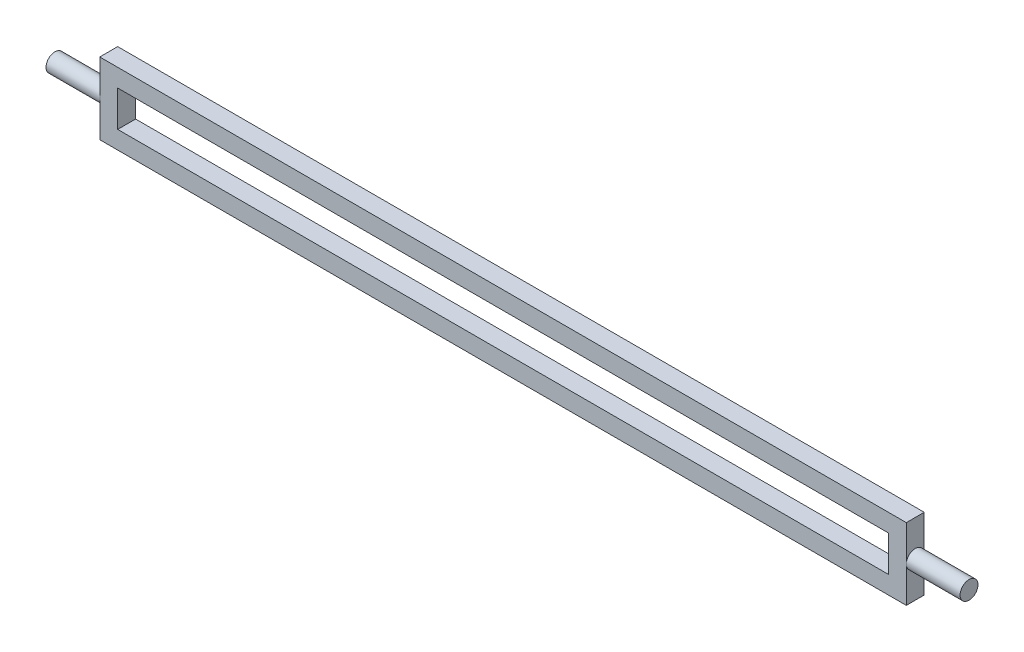
ISO-10303-21;
HEADER;
FILE_DESCRIPTION(('STEP AP214'),'2;1');
FILE_NAME('part.step','',(''),(''),'','','');
FILE_SCHEMA(('AUTOMOTIVE_DESIGN { 1 0 10303 214 1 1 1 1 }'));
ENDSEC;
DATA;
#1=APPLICATION_CONTEXT('core data for automotive mechanical design processes');
#2=APPLICATION_PROTOCOL_DEFINITION('international standard','automotive_design',2000,#1);
#3=PRODUCT_CONTEXT('',#1,'mechanical');
#4=PRODUCT('Part','Part','',(#3));
#5=PRODUCT_RELATED_PRODUCT_CATEGORY('part','',(#4));
#6=PRODUCT_DEFINITION_FORMATION('','',#4);
#7=PRODUCT_DEFINITION_CONTEXT('part definition',#1,'design');
#8=PRODUCT_DEFINITION('design','',#6,#7);
#9=PRODUCT_DEFINITION_SHAPE('','',#8);
#10=(LENGTH_UNIT() NAMED_UNIT(*) SI_UNIT(.MILLI.,.METRE.));
#11=(NAMED_UNIT(*) PLANE_ANGLE_UNIT() SI_UNIT($,.RADIAN.));
#12=(NAMED_UNIT(*) SI_UNIT($,.STERADIAN.) SOLID_ANGLE_UNIT());
#13=UNCERTAINTY_MEASURE_WITH_UNIT(LENGTH_MEASURE(1.E-05),#10,'distance_accuracy_value','');
#14=(GEOMETRIC_REPRESENTATION_CONTEXT(3) GLOBAL_UNCERTAINTY_ASSIGNED_CONTEXT((#13)) GLOBAL_UNIT_ASSIGNED_CONTEXT((#10,
#11,#12)) REPRESENTATION_CONTEXT('',''));
#15=CARTESIAN_POINT('',(0.,0.,0.));
#16=DIRECTION('',(0.,0.,1.));
#17=DIRECTION('',(1.,0.,0.));
#18=AXIS2_PLACEMENT_3D('',#15,#16,#17);
#19=CARTESIAN_POINT('',(0.,0.,5.));
#20=DIRECTION('',(1.,0.,0.));
#21=DIRECTION('',(0.,0.,-1.));
#22=AXIS2_PLACEMENT_3D('',#19,#20,#21);
#23=PLANE('',#22);
#24=CARTESIAN_POINT('',(0.,10.,2.5));
#25=DIRECTION('',(-1.,0.,0.));
#26=DIRECTION('',(0.,0.,1.));
#27=AXIS2_PLACEMENT_3D('',#24,#25,#26);
#28=CIRCLE('',#27,2.5);
#29=CARTESIAN_POINT('',(0.,10.,5.));
#30=VERTEX_POINT('',#29);
#31=CARTESIAN_POINT('',(0.,10.,0.));
#32=VERTEX_POINT('',#31);
#33=EDGE_CURVE('E44',#30,#32,#28,.T.);
#34=ORIENTED_EDGE('',*,*,#33,.F.);
#35=DIRECTION('',(0.,-1.,0.));
#36=VECTOR('',#35,1.);
#37=CARTESIAN_POINT('',(0.,0.,5.));
#38=LINE('',#37,#36);
#39=CARTESIAN_POINT('',(0.,20.,5.));
#40=VERTEX_POINT('',#39);
#41=EDGE_CURVE('E160',#40,#30,#38,.T.);
#42=ORIENTED_EDGE('',*,*,#41,.F.);
#43=DIRECTION('',(0.,0.,-1.));
#44=VECTOR('',#43,1.);
#45=CARTESIAN_POINT('',(0.,20.,5.));
#46=LINE('',#45,#44);
#47=CARTESIAN_POINT('',(0.,20.,0.));
#48=VERTEX_POINT('',#47);
#49=EDGE_CURVE('E171',#40,#48,#46,.T.);
#50=ORIENTED_EDGE('',*,*,#49,.T.);
#51=DIRECTION('',(0.,-1.,0.));
#52=VECTOR('',#51,1.);
#53=CARTESIAN_POINT('',(0.,0.,0.));
#54=LINE('',#53,#52);
#55=EDGE_CURVE('E172',#48,#32,#54,.T.);
#56=ORIENTED_EDGE('',*,*,#55,.T.);
#57=EDGE_LOOP('',(#34,#42,#50,#56));
#58=FACE_BOUND('',#57,.T.);
#59=ADVANCED_FACE('F33',(#58),#23,.F.);
#60=CARTESIAN_POINT('',(225.,0.,5.));
#61=DIRECTION('',(-1.,0.,0.));
#62=DIRECTION('',(0.,0.,1.));
#63=AXIS2_PLACEMENT_3D('',#60,#61,#62);
#64=PLANE('',#63);
#65=CARTESIAN_POINT('',(225.,10.,2.5));
#66=DIRECTION('',(1.,0.,0.));
#67=DIRECTION('',(0.,0.,-1.));
#68=AXIS2_PLACEMENT_3D('',#65,#66,#67);
#69=CIRCLE('',#68,2.5);
#70=CARTESIAN_POINT('',(225.,10.,0.));
#71=VERTEX_POINT('',#70);
#72=CARTESIAN_POINT('',(225.,10.,5.));
#73=VERTEX_POINT('',#72);
#74=EDGE_CURVE('E151',#71,#73,#69,.T.);
#75=ORIENTED_EDGE('',*,*,#74,.F.);
#76=DIRECTION('',(0.,1.,0.));
#77=VECTOR('',#76,1.);
#78=CARTESIAN_POINT('',(225.,0.,0.));
#79=LINE('',#78,#77);
#80=CARTESIAN_POINT('',(225.,20.,0.));
#81=VERTEX_POINT('',#80);
#82=EDGE_CURVE('E177',#71,#81,#79,.T.);
#83=ORIENTED_EDGE('',*,*,#82,.T.);
#84=DIRECTION('',(0.,0.,-1.));
#85=VECTOR('',#84,1.);
#86=CARTESIAN_POINT('',(225.,20.,5.));
#87=LINE('',#86,#85);
#88=CARTESIAN_POINT('',(225.,20.,5.));
#89=VERTEX_POINT('',#88);
#90=EDGE_CURVE('E184',#89,#81,#87,.T.);
#91=ORIENTED_EDGE('',*,*,#90,.F.);
#92=DIRECTION('',(0.,1.,0.));
#93=VECTOR('',#92,1.);
#94=CARTESIAN_POINT('',(225.,0.,5.));
#95=LINE('',#94,#93);
#96=EDGE_CURVE('E165',#73,#89,#95,.T.);
#97=ORIENTED_EDGE('',*,*,#96,.F.);
#98=EDGE_LOOP('',(#75,#83,#91,#97));
#99=FACE_BOUND('',#98,.T.);
#100=ADVANCED_FACE('F205',(#99),#64,.F.);
#101=EDGE_CURVE('E11',#32,#30,#28,.T.);
#102=ORIENTED_EDGE('',*,*,#101,.F.);
#103=CARTESIAN_POINT('',(0.,0.,0.));
#104=VERTEX_POINT('',#103);
#105=EDGE_CURVE('E157',#32,#104,#54,.T.);
#106=ORIENTED_EDGE('',*,*,#105,.T.);
#107=DIRECTION('',(0.,0.,-1.));
#108=VECTOR('',#107,1.);
#109=CARTESIAN_POINT('',(0.,0.,5.));
#110=LINE('',#109,#108);
#111=CARTESIAN_POINT('',(0.,0.,5.));
#112=VERTEX_POINT('',#111);
#113=EDGE_CURVE('E37',#112,#104,#110,.T.);
#114=ORIENTED_EDGE('',*,*,#113,.F.);
#115=EDGE_CURVE('E163',#30,#112,#38,.T.);
#116=ORIENTED_EDGE('',*,*,#115,.F.);
#117=EDGE_LOOP('',(#102,#106,#114,#116));
#118=FACE_BOUND('',#117,.T.);
#119=ADVANCED_FACE('F35',(#118),#23,.F.);
#120=CARTESIAN_POINT('',(0.,0.,5.));
#121=DIRECTION('',(0.,1.,0.));
#122=DIRECTION('',(0.,0.,1.));
#123=AXIS2_PLACEMENT_3D('',#120,#121,#122);
#124=PLANE('',#123);
#125=DIRECTION('',(1.,0.,0.));
#126=VECTOR('',#125,1.);
#127=CARTESIAN_POINT('',(0.,0.,0.));
#128=LINE('',#127,#126);
#129=CARTESIAN_POINT('',(225.,0.,0.));
#130=VERTEX_POINT('',#129);
#131=EDGE_CURVE('E175',#104,#130,#128,.T.);
#132=ORIENTED_EDGE('',*,*,#131,.T.);
#133=DIRECTION('',(0.,0.,-1.));
#134=VECTOR('',#133,1.);
#135=CARTESIAN_POINT('',(225.,0.,5.));
#136=LINE('',#135,#134);
#137=CARTESIAN_POINT('',(225.,0.,5.));
#138=VERTEX_POINT('',#137);
#139=EDGE_CURVE('E186',#138,#130,#136,.T.);
#140=ORIENTED_EDGE('',*,*,#139,.F.);
#141=DIRECTION('',(1.,0.,0.));
#142=VECTOR('',#141,1.);
#143=CARTESIAN_POINT('',(0.,0.,5.));
#144=LINE('',#143,#142);
#145=EDGE_CURVE('E162',#112,#138,#144,.T.);
#146=ORIENTED_EDGE('',*,*,#145,.F.);
#147=ORIENTED_EDGE('',*,*,#113,.T.);
#148=EDGE_LOOP('',(#132,#140,#146,#147));
#149=FACE_BOUND('',#148,.T.);
#150=ADVANCED_FACE('F210',(#149),#124,.F.);
#151=EDGE_CURVE('E42',#73,#71,#69,.T.);
#152=ORIENTED_EDGE('',*,*,#151,.F.);
#153=EDGE_CURVE('E166',#138,#73,#95,.T.);
#154=ORIENTED_EDGE('',*,*,#153,.F.);
#155=ORIENTED_EDGE('',*,*,#139,.T.);
#156=EDGE_CURVE('E178',#130,#71,#79,.T.);
#157=ORIENTED_EDGE('',*,*,#156,.T.);
#158=EDGE_LOOP('',(#152,#154,#155,#157));
#159=FACE_BOUND('',#158,.T.);
#160=ADVANCED_FACE('F201',(#159),#64,.F.);
#161=CARTESIAN_POINT('',(0.,20.,5.));
#162=DIRECTION('',(0.,-1.,0.));
#163=DIRECTION('',(0.,0.,-1.));
#164=AXIS2_PLACEMENT_3D('',#161,#162,#163);
#165=PLANE('',#164);
#166=DIRECTION('',(-1.,0.,0.));
#167=VECTOR('',#166,1.);
#168=CARTESIAN_POINT('',(0.,20.,0.));
#169=LINE('',#168,#167);
#170=EDGE_CURVE('E180',#81,#48,#169,.T.);
#171=ORIENTED_EDGE('',*,*,#170,.T.);
#172=ORIENTED_EDGE('',*,*,#49,.F.);
#173=DIRECTION('',(-1.,0.,0.));
#174=VECTOR('',#173,1.);
#175=CARTESIAN_POINT('',(0.,20.,5.));
#176=LINE('',#175,#174);
#177=EDGE_CURVE('E169',#89,#40,#176,.T.);
#178=ORIENTED_EDGE('',*,*,#177,.F.);
#179=ORIENTED_EDGE('',*,*,#90,.T.);
#180=EDGE_LOOP('',(#171,#172,#178,#179));
#181=FACE_BOUND('',#180,.T.);
#182=ADVANCED_FACE('F216',(#181),#165,.F.);
#183=CARTESIAN_POINT('',(0.,0.,5.));
#184=DIRECTION('',(0.,0.,-1.));
#185=DIRECTION('',(-1.,0.,0.));
#186=AXIS2_PLACEMENT_3D('',#183,#184,#185);
#187=PLANE('',#186);
#188=DIRECTION('',(0.,1.,0.));
#189=VECTOR('',#188,1.);
#190=CARTESIAN_POINT('',(220.,5.,5.));
#191=LINE('',#190,#189);
#192=CARTESIAN_POINT('',(220.,5.,5.));
#193=VERTEX_POINT('',#192);
#194=CARTESIAN_POINT('',(220.,15.,5.));
#195=VERTEX_POINT('',#194);
#196=EDGE_CURVE('E140',#193,#195,#191,.T.);
#197=ORIENTED_EDGE('',*,*,#196,.F.);
#198=DIRECTION('',(1.,0.,0.));
#199=VECTOR('',#198,1.);
#200=CARTESIAN_POINT('',(5.,5.,5.));
#201=LINE('',#200,#199);
#202=CARTESIAN_POINT('',(5.,5.,5.));
#203=VERTEX_POINT('',#202);
#204=EDGE_CURVE('E51',#203,#193,#201,.T.);
#205=ORIENTED_EDGE('',*,*,#204,.F.);
#206=DIRECTION('',(0.,-1.,0.));
#207=VECTOR('',#206,1.);
#208=CARTESIAN_POINT('',(5.,5.,5.));
#209=LINE('',#208,#207);
#210=CARTESIAN_POINT('',(5.,15.,5.));
#211=VERTEX_POINT('',#210);
#212=EDGE_CURVE('E131',#211,#203,#209,.T.);
#213=ORIENTED_EDGE('',*,*,#212,.F.);
#214=DIRECTION('',(-1.,0.,0.));
#215=VECTOR('',#214,1.);
#216=CARTESIAN_POINT('',(5.,15.,5.));
#217=LINE('',#216,#215);
#218=EDGE_CURVE('E134',#195,#211,#217,.T.);
#219=ORIENTED_EDGE('',*,*,#218,.F.);
#220=EDGE_LOOP('',(#197,#205,#213,#219));
#221=FACE_BOUND('',#220,.T.);
#222=ORIENTED_EDGE('',*,*,#41,.T.);
#223=ORIENTED_EDGE('',*,*,#115,.T.);
#224=ORIENTED_EDGE('',*,*,#145,.T.);
#225=ORIENTED_EDGE('',*,*,#153,.T.);
#226=ORIENTED_EDGE('',*,*,#96,.T.);
#227=ORIENTED_EDGE('',*,*,#177,.T.);
#228=EDGE_LOOP('',(#222,#223,#224,#225,#226,#227));
#229=FACE_BOUND('',#228,.T.);
#230=ADVANCED_FACE('F208',(#221,#229),#187,.F.);
#231=CARTESIAN_POINT('',(0.,0.,0.));
#232=DIRECTION('',(0.,0.,-1.));
#233=DIRECTION('',(-1.,0.,0.));
#234=AXIS2_PLACEMENT_3D('',#231,#232,#233);
#235=PLANE('',#234);
#236=DIRECTION('',(1.,0.,0.));
#237=VECTOR('',#236,1.);
#238=CARTESIAN_POINT('',(5.,5.,0.));
#239=LINE('',#238,#237);
#240=CARTESIAN_POINT('',(5.,5.,0.));
#241=VERTEX_POINT('',#240);
#242=CARTESIAN_POINT('',(220.,5.,0.));
#243=VERTEX_POINT('',#242);
#244=EDGE_CURVE('E115',#241,#243,#239,.T.);
#245=ORIENTED_EDGE('',*,*,#244,.T.);
#246=DIRECTION('',(0.,1.,0.));
#247=VECTOR('',#246,1.);
#248=CARTESIAN_POINT('',(220.,5.,0.));
#249=LINE('',#248,#247);
#250=CARTESIAN_POINT('',(220.,15.,0.));
#251=VERTEX_POINT('',#250);
#252=EDGE_CURVE('E124',#243,#251,#249,.T.);
#253=ORIENTED_EDGE('',*,*,#252,.T.);
#254=DIRECTION('',(-1.,0.,0.));
#255=VECTOR('',#254,1.);
#256=CARTESIAN_POINT('',(5.,15.,0.));
#257=LINE('',#256,#255);
#258=CARTESIAN_POINT('',(5.,15.,0.));
#259=VERTEX_POINT('',#258);
#260=EDGE_CURVE('E59',#251,#259,#257,.T.);
#261=ORIENTED_EDGE('',*,*,#260,.T.);
#262=DIRECTION('',(0.,-1.,0.));
#263=VECTOR('',#262,1.);
#264=CARTESIAN_POINT('',(5.,5.,0.));
#265=LINE('',#264,#263);
#266=EDGE_CURVE('E121',#259,#241,#265,.T.);
#267=ORIENTED_EDGE('',*,*,#266,.T.);
#268=EDGE_LOOP('',(#245,#253,#261,#267));
#269=FACE_BOUND('',#268,.T.);
#270=ORIENTED_EDGE('',*,*,#55,.F.);
#271=ORIENTED_EDGE('',*,*,#170,.F.);
#272=ORIENTED_EDGE('',*,*,#82,.F.);
#273=ORIENTED_EDGE('',*,*,#156,.F.);
#274=ORIENTED_EDGE('',*,*,#131,.F.);
#275=ORIENTED_EDGE('',*,*,#105,.F.);
#276=EDGE_LOOP('',(#270,#271,#272,#273,#274,#275));
#277=FACE_BOUND('',#276,.T.);
#278=ADVANCED_FACE('F128',(#269,#277),#235,.T.);
#279=CARTESIAN_POINT('',(240.,10.,2.5));
#280=DIRECTION('',(-1.,0.,0.));
#281=DIRECTION('',(0.,0.,1.));
#282=AXIS2_PLACEMENT_3D('',#279,#280,#281);
#283=CYLINDRICAL_SURFACE('',#282,2.5);
#284=CARTESIAN_POINT('',(240.,10.,2.5));
#285=DIRECTION('',(1.,0.,0.));
#286=DIRECTION('',(0.,0.,-1.));
#287=AXIS2_PLACEMENT_3D('',#284,#285,#286);
#288=CIRCLE('',#287,2.5);
#289=CARTESIAN_POINT('',(240.,10.,0.));
#290=VERTEX_POINT('',#289);
#291=EDGE_CURVE('E154',#290,#290,#288,.T.);
#292=ORIENTED_EDGE('',*,*,#291,.F.);
#293=EDGE_LOOP('',(#292));
#294=FACE_BOUND('',#293,.T.);
#295=ORIENTED_EDGE('',*,*,#74,.T.);
#296=ORIENTED_EDGE('',*,*,#151,.T.);
#297=EDGE_LOOP('',(#295,#296));
#298=FACE_BOUND('',#297,.T.);
#299=ADVANCED_FACE('F198',(#294,#298),#283,.T.);
#300=CARTESIAN_POINT('',(240.,10.,2.5));
#301=DIRECTION('',(1.,0.,0.));
#302=DIRECTION('',(0.,0.,-1.));
#303=AXIS2_PLACEMENT_3D('',#300,#301,#302);
#304=PLANE('',#303);
#305=ORIENTED_EDGE('',*,*,#291,.T.);
#306=EDGE_LOOP('',(#305));
#307=FACE_BOUND('',#306,.T.);
#308=ADVANCED_FACE('F226',(#307),#304,.T.);
#309=CARTESIAN_POINT('',(-15.,10.,2.5));
#310=DIRECTION('',(1.,0.,0.));
#311=DIRECTION('',(0.,0.,-1.));
#312=AXIS2_PLACEMENT_3D('',#309,#310,#311);
#313=CYLINDRICAL_SURFACE('',#312,2.5);
#314=CARTESIAN_POINT('',(-15.,10.,2.5));
#315=DIRECTION('',(-1.,0.,0.));
#316=DIRECTION('',(0.,0.,1.));
#317=AXIS2_PLACEMENT_3D('',#314,#315,#316);
#318=CIRCLE('',#317,2.5);
#319=CARTESIAN_POINT('',(-15.,10.,5.));
#320=VERTEX_POINT('',#319);
#321=EDGE_CURVE('E149',#320,#320,#318,.T.);
#322=ORIENTED_EDGE('',*,*,#321,.F.);
#323=EDGE_LOOP('',(#322));
#324=FACE_BOUND('',#323,.T.);
#325=ORIENTED_EDGE('',*,*,#33,.T.);
#326=ORIENTED_EDGE('',*,*,#101,.T.);
#327=EDGE_LOOP('',(#325,#326));
#328=FACE_BOUND('',#327,.T.);
#329=ADVANCED_FACE('F223',(#324,#328),#313,.T.);
#330=CARTESIAN_POINT('',(-15.,10.,2.5));
#331=DIRECTION('',(-1.,0.,0.));
#332=DIRECTION('',(0.,0.,1.));
#333=AXIS2_PLACEMENT_3D('',#330,#331,#332);
#334=PLANE('',#333);
#335=ORIENTED_EDGE('',*,*,#321,.T.);
#336=EDGE_LOOP('',(#335));
#337=FACE_BOUND('',#336,.T.);
#338=ADVANCED_FACE('F225',(#337),#334,.T.);
#339=CARTESIAN_POINT('',(5.,5.,0.));
#340=DIRECTION('',(0.,-1.,0.));
#341=DIRECTION('',(0.,0.,-1.));
#342=AXIS2_PLACEMENT_3D('',#339,#340,#341);
#343=PLANE('',#342);
#344=ORIENTED_EDGE('',*,*,#204,.T.);
#345=DIRECTION('',(0.,0.,1.));
#346=VECTOR('',#345,1.);
#347=CARTESIAN_POINT('',(220.,5.,0.));
#348=LINE('',#347,#346);
#349=EDGE_CURVE('E111',#243,#193,#348,.T.);
#350=ORIENTED_EDGE('',*,*,#349,.F.);
#351=ORIENTED_EDGE('',*,*,#244,.F.);
#352=DIRECTION('',(0.,0.,1.));
#353=VECTOR('',#352,1.);
#354=CARTESIAN_POINT('',(5.,5.,0.));
#355=LINE('',#354,#353);
#356=EDGE_CURVE('E144',#241,#203,#355,.T.);
#357=ORIENTED_EDGE('',*,*,#356,.T.);
#358=EDGE_LOOP('',(#344,#350,#351,#357));
#359=FACE_BOUND('',#358,.T.);
#360=ADVANCED_FACE('F113',(#359),#343,.F.);
#361=CARTESIAN_POINT('',(5.,5.,0.));
#362=DIRECTION('',(-1.,0.,0.));
#363=DIRECTION('',(0.,0.,1.));
#364=AXIS2_PLACEMENT_3D('',#361,#362,#363);
#365=PLANE('',#364);
#366=ORIENTED_EDGE('',*,*,#212,.T.);
#367=ORIENTED_EDGE('',*,*,#356,.F.);
#368=ORIENTED_EDGE('',*,*,#266,.F.);
#369=DIRECTION('',(0.,0.,1.));
#370=VECTOR('',#369,1.);
#371=CARTESIAN_POINT('',(5.,15.,0.));
#372=LINE('',#371,#370);
#373=EDGE_CURVE('E146',#259,#211,#372,.T.);
#374=ORIENTED_EDGE('',*,*,#373,.T.);
#375=EDGE_LOOP('',(#366,#367,#368,#374));
#376=FACE_BOUND('',#375,.T.);
#377=ADVANCED_FACE('F310',(#376),#365,.F.);
#378=CARTESIAN_POINT('',(5.,15.,0.));
#379=DIRECTION('',(0.,1.,0.));
#380=DIRECTION('',(0.,0.,1.));
#381=AXIS2_PLACEMENT_3D('',#378,#379,#380);
#382=PLANE('',#381);
#383=ORIENTED_EDGE('',*,*,#218,.T.);
#384=ORIENTED_EDGE('',*,*,#373,.F.);
#385=ORIENTED_EDGE('',*,*,#260,.F.);
#386=DIRECTION('',(0.,0.,1.));
#387=VECTOR('',#386,1.);
#388=CARTESIAN_POINT('',(220.,15.,0.));
#389=LINE('',#388,#387);
#390=EDGE_CURVE('E120',#251,#195,#389,.T.);
#391=ORIENTED_EDGE('',*,*,#390,.T.);
#392=EDGE_LOOP('',(#383,#384,#385,#391));
#393=FACE_BOUND('',#392,.T.);
#394=ADVANCED_FACE('F319',(#393),#382,.F.);
#395=CARTESIAN_POINT('',(220.,5.,0.));
#396=DIRECTION('',(1.,0.,0.));
#397=DIRECTION('',(0.,0.,-1.));
#398=AXIS2_PLACEMENT_3D('',#395,#396,#397);
#399=PLANE('',#398);
#400=ORIENTED_EDGE('',*,*,#196,.T.);
#401=ORIENTED_EDGE('',*,*,#390,.F.);
#402=ORIENTED_EDGE('',*,*,#252,.F.);
#403=ORIENTED_EDGE('',*,*,#349,.T.);
#404=EDGE_LOOP('',(#400,#401,#402,#403));
#405=FACE_BOUND('',#404,.T.);
#406=ADVANCED_FACE('F125',(#405),#399,.F.);
#407=CLOSED_SHELL('',(#59,#100,#119,#150,#160,#182,#230,#278,#299,#308,#329,#338,#360,#377,#394,#406));
#408=MANIFOLD_SOLID_BREP('B2',#407);
#409=ADVANCED_BREP_SHAPE_REPRESENTATION('',(#18,#408),#14);
#410=SHAPE_DEFINITION_REPRESENTATION(#9,#409);
ENDSEC;
END-ISO-10303-21;
